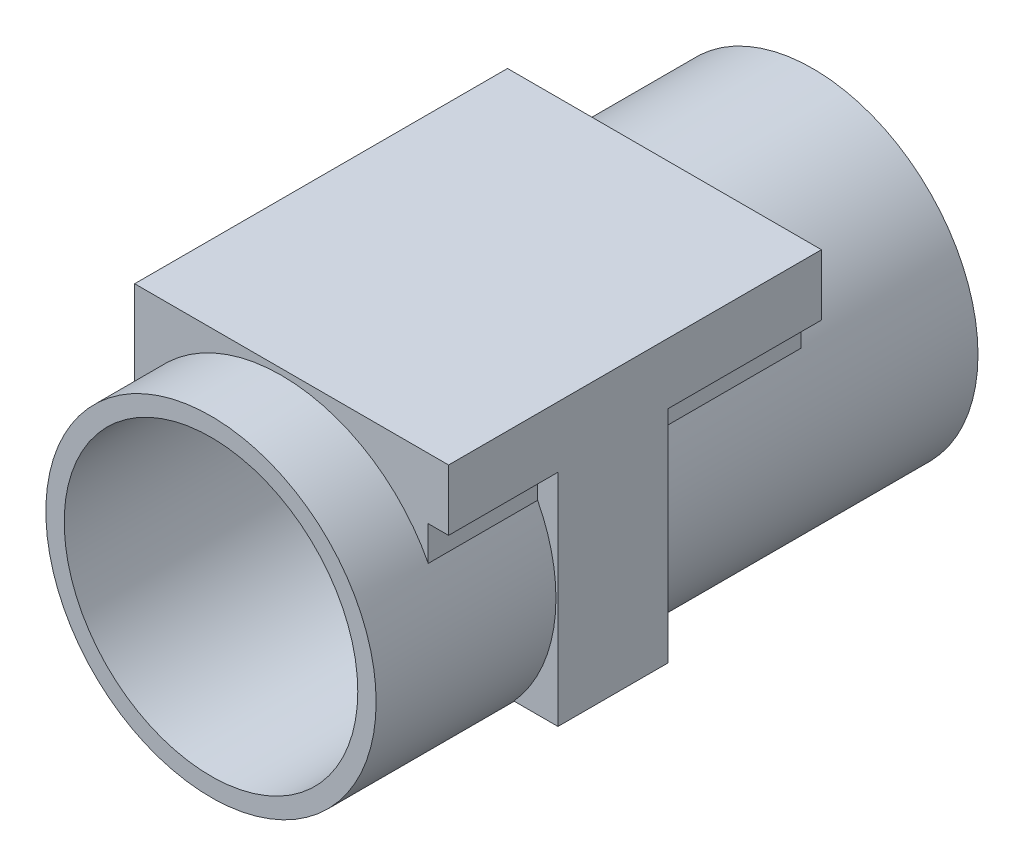
ISO-10303-21;
HEADER;
FILE_DESCRIPTION(('STEP AP214'),'2;1');
FILE_NAME('part.step','',(''),(''),'','','');
FILE_SCHEMA(('AUTOMOTIVE_DESIGN { 1 0 10303 214 1 1 1 1 }'));
ENDSEC;
DATA;
#1=APPLICATION_CONTEXT('core data for automotive mechanical design processes');
#2=APPLICATION_PROTOCOL_DEFINITION('international standard','automotive_design',2000,#1);
#3=PRODUCT_CONTEXT('',#1,'mechanical');
#4=PRODUCT('Part','Part','',(#3));
#5=PRODUCT_RELATED_PRODUCT_CATEGORY('part','',(#4));
#6=PRODUCT_DEFINITION_FORMATION('','',#4);
#7=PRODUCT_DEFINITION_CONTEXT('part definition',#1,'design');
#8=PRODUCT_DEFINITION('design','',#6,#7);
#9=PRODUCT_DEFINITION_SHAPE('','',#8);
#10=(LENGTH_UNIT() NAMED_UNIT(*) SI_UNIT(.MILLI.,.METRE.));
#11=(NAMED_UNIT(*) PLANE_ANGLE_UNIT() SI_UNIT($,.RADIAN.));
#12=(NAMED_UNIT(*) SI_UNIT($,.STERADIAN.) SOLID_ANGLE_UNIT());
#13=UNCERTAINTY_MEASURE_WITH_UNIT(LENGTH_MEASURE(1.E-05),#10,'distance_accuracy_value','');
#14=(GEOMETRIC_REPRESENTATION_CONTEXT(3) GLOBAL_UNCERTAINTY_ASSIGNED_CONTEXT((#13)) GLOBAL_UNIT_ASSIGNED_CONTEXT((#10,
#11,#12)) REPRESENTATION_CONTEXT('',''));
#15=CARTESIAN_POINT('',(0.,0.,0.));
#16=DIRECTION('',(0.,0.,1.));
#17=DIRECTION('',(1.,0.,0.));
#18=AXIS2_PLACEMENT_3D('',#15,#16,#17);
#19=CARTESIAN_POINT('',(0.,0.,0.));
#20=DIRECTION('',(0.,0.,1.));
#21=DIRECTION('',(1.,0.,0.));
#22=AXIS2_PLACEMENT_3D('',#19,#20,#21);
#23=CYLINDRICAL_SURFACE('',#22,22.5);
#24=DIRECTION('',(0.,0.,-1.));
#25=VECTOR('',#24,1.);
#26=CARTESIAN_POINT('',(20.,10.3077640640442,70.4));
#27=LINE('',#26,#25);
#28=CARTESIAN_POINT('',(20.,10.3077640640441,70.4));
#29=VERTEX_POINT('',#28);
#30=CARTESIAN_POINT('',(20.,10.3077640640442,55.5));
#31=VERTEX_POINT('',#30);
#32=EDGE_CURVE('E52',#29,#31,#27,.T.);
#33=ORIENTED_EDGE('',*,*,#32,.F.);
#34=CARTESIAN_POINT('',(0.,-1.6306400674182E-13,70.4));
#35=DIRECTION('',(0.,0.,-1.));
#36=DIRECTION('',(-1.,0.,0.));
#37=AXIS2_PLACEMENT_3D('',#34,#35,#36);
#38=CIRCLE('',#37,22.5000000000001);
#39=CARTESIAN_POINT('',(-20.,10.3077640640441,70.4));
#40=VERTEX_POINT('',#39);
#41=EDGE_CURVE('E56',#40,#29,#38,.T.);
#42=ORIENTED_EDGE('',*,*,#41,.F.);
#43=DIRECTION('',(0.,0.,-1.));
#44=VECTOR('',#43,1.);
#45=CARTESIAN_POINT('',(-20.,10.3077640640442,70.4));
#46=LINE('',#45,#44);
#47=CARTESIAN_POINT('',(-20.,10.3077640640442,19.6));
#48=VERTEX_POINT('',#47);
#49=EDGE_CURVE('E178',#40,#48,#46,.T.);
#50=ORIENTED_EDGE('',*,*,#49,.T.);
#51=CARTESIAN_POINT('',(0.,-1.6306400674182E-13,19.6));
#52=DIRECTION('',(0.,0.,-1.));
#53=DIRECTION('',(-1.,0.,0.));
#54=AXIS2_PLACEMENT_3D('',#51,#52,#53);
#55=CIRCLE('',#54,22.5000000000001);
#56=CARTESIAN_POINT('',(20.,10.3077640640441,19.6));
#57=VERTEX_POINT('',#56);
#58=EDGE_CURVE('E140',#48,#57,#55,.T.);
#59=ORIENTED_EDGE('',*,*,#58,.T.);
#60=CARTESIAN_POINT('',(20.,10.3077640640442,40.5));
#61=VERTEX_POINT('',#60);
#62=EDGE_CURVE('E137',#61,#57,#27,.T.);
#63=ORIENTED_EDGE('',*,*,#62,.F.);
#64=CARTESIAN_POINT('',(0.,0.,40.5));
#65=DIRECTION('',(0.,0.,1.));
#66=DIRECTION('',(-1.,0.,0.));
#67=AXIS2_PLACEMENT_3D('',#64,#65,#66);
#68=CIRCLE('',#67,22.5);
#69=CARTESIAN_POINT('',(16.7705098312484,-15.,40.5));
#70=VERTEX_POINT('',#69);
#71=EDGE_CURVE('E186',#70,#61,#68,.T.);
#72=ORIENTED_EDGE('',*,*,#71,.F.);
#73=DIRECTION('',(0.,0.,-1.));
#74=VECTOR('',#73,1.);
#75=CARTESIAN_POINT('',(16.7705098312484,-15.,55.5));
#76=LINE('',#75,#74);
#77=CARTESIAN_POINT('',(16.7705098312484,-15.,55.5));
#78=VERTEX_POINT('',#77);
#79=EDGE_CURVE('E204',#78,#70,#76,.T.);
#80=ORIENTED_EDGE('',*,*,#79,.F.);
#81=CARTESIAN_POINT('',(0.,0.,55.5));
#82=DIRECTION('',(0.,0.,1.));
#83=DIRECTION('',(-1.,0.,0.));
#84=AXIS2_PLACEMENT_3D('',#81,#82,#83);
#85=CIRCLE('',#84,22.5);
#86=EDGE_CURVE('E195',#78,#31,#85,.T.);
#87=ORIENTED_EDGE('',*,*,#86,.T.);
#88=EDGE_LOOP('',(#33,#42,#50,#59,#63,#72,#80,#87));
#89=FACE_BOUND('',#88,.T.);
#90=CARTESIAN_POINT('',(0.,0.,-2.));
#91=DIRECTION('',(0.,0.,1.));
#92=DIRECTION('',(1.,0.,0.));
#93=AXIS2_PLACEMENT_3D('',#90,#91,#92);
#94=CIRCLE('',#93,22.5);
#95=CARTESIAN_POINT('',(22.5,0.,-2.));
#96=VERTEX_POINT('',#95);
#97=EDGE_CURVE('E45',#96,#96,#94,.T.);
#98=ORIENTED_EDGE('',*,*,#97,.T.);
#99=EDGE_LOOP('',(#98));
#100=FACE_BOUND('',#99,.T.);
#101=CARTESIAN_POINT('',(0.,0.,80.));
#102=DIRECTION('',(0.,0.,1.));
#103=DIRECTION('',(1.,0.,0.));
#104=AXIS2_PLACEMENT_3D('',#101,#102,#103);
#105=CIRCLE('',#104,22.5);
#106=CARTESIAN_POINT('',(22.5,0.,80.));
#107=VERTEX_POINT('',#106);
#108=EDGE_CURVE('E214',#107,#107,#105,.T.);
#109=ORIENTED_EDGE('',*,*,#108,.F.);
#110=EDGE_LOOP('',(#109));
#111=FACE_BOUND('',#110,.T.);
#112=ADVANCED_FACE('F37',(#89,#100,#111),#23,.T.);
#113=CARTESIAN_POINT('',(0.,-20.,0.));
#114=DIRECTION('',(0.,0.,1.));
#115=DIRECTION('',(1.,0.,0.));
#116=AXIS2_PLACEMENT_3D('',#113,#114,#115);
#117=PLANE('',#116);
#118=CARTESIAN_POINT('',(0.,0.,0.));
#119=DIRECTION('',(0.,0.,1.));
#120=DIRECTION('',(1.,0.,0.));
#121=AXIS2_PLACEMENT_3D('',#118,#119,#120);
#122=CIRCLE('',#121,20.);
#123=CARTESIAN_POINT('',(20.,0.,0.));
#124=VERTEX_POINT('',#123);
#125=EDGE_CURVE('E207',#124,#124,#122,.T.);
#126=ORIENTED_EDGE('',*,*,#125,.T.);
#127=EDGE_LOOP('',(#126));
#128=FACE_BOUND('',#127,.T.);
#129=ADVANCED_FACE('F39',(#128),#117,.T.);
#130=CARTESIAN_POINT('',(0.,0.,-2.));
#131=DIRECTION('',(0.,0.,-1.));
#132=DIRECTION('',(-1.,0.,0.));
#133=AXIS2_PLACEMENT_3D('',#130,#131,#132);
#134=PLANE('',#133);
#135=ORIENTED_EDGE('',*,*,#97,.F.);
#136=EDGE_LOOP('',(#135));
#137=FACE_BOUND('',#136,.T.);
#138=ADVANCED_FACE('F221',(#137),#134,.T.);
#139=CARTESIAN_POINT('',(0.,-22.5,80.));
#140=DIRECTION('',(0.,0.,1.));
#141=DIRECTION('',(1.,0.,0.));
#142=AXIS2_PLACEMENT_3D('',#139,#140,#141);
#143=PLANE('',#142);
#144=ORIENTED_EDGE('',*,*,#108,.T.);
#145=EDGE_LOOP('',(#144));
#146=FACE_BOUND('',#145,.T.);
#147=CARTESIAN_POINT('',(0.,0.,80.));
#148=DIRECTION('',(0.,0.,1.));
#149=DIRECTION('',(1.,0.,0.));
#150=AXIS2_PLACEMENT_3D('',#147,#148,#149);
#151=CIRCLE('',#150,20.);
#152=CARTESIAN_POINT('',(20.,0.,80.));
#153=VERTEX_POINT('',#152);
#154=EDGE_CURVE('E211',#153,#153,#151,.T.);
#155=ORIENTED_EDGE('',*,*,#154,.F.);
#156=EDGE_LOOP('',(#155));
#157=FACE_BOUND('',#156,.T.);
#158=ADVANCED_FACE('F223',(#146,#157),#143,.T.);
#159=CARTESIAN_POINT('',(0.,0.,0.));
#160=DIRECTION('',(0.,0.,1.));
#161=DIRECTION('',(1.,0.,0.));
#162=AXIS2_PLACEMENT_3D('',#159,#160,#161);
#163=CYLINDRICAL_SURFACE('',#162,20.);
#164=ORIENTED_EDGE('',*,*,#154,.T.);
#165=EDGE_LOOP('',(#164));
#166=FACE_BOUND('',#165,.T.);
#167=ORIENTED_EDGE('',*,*,#125,.F.);
#168=EDGE_LOOP('',(#167));
#169=FACE_BOUND('',#168,.T.);
#170=ADVANCED_FACE('F228',(#166,#169),#163,.F.);
#171=CARTESIAN_POINT('',(22.7705098312484,-15.,55.5));
#172=DIRECTION('',(0.,-1.,0.));
#173=DIRECTION('',(1.,0.,0.));
#174=AXIS2_PLACEMENT_3D('',#171,#172,#173);
#175=PLANE('',#174);
#176=ORIENTED_EDGE('',*,*,#79,.T.);
#177=DIRECTION('',(-1.,0.,0.));
#178=VECTOR('',#177,1.);
#179=CARTESIAN_POINT('',(22.7705098312484,-15.,40.5));
#180=LINE('',#179,#178);
#181=CARTESIAN_POINT('',(22.7705098312484,-15.,40.5));
#182=VERTEX_POINT('',#181);
#183=EDGE_CURVE('E192',#182,#70,#180,.T.);
#184=ORIENTED_EDGE('',*,*,#183,.F.);
#185=DIRECTION('',(0.,0.,-1.));
#186=VECTOR('',#185,1.);
#187=CARTESIAN_POINT('',(22.7705098312484,-15.,55.5));
#188=LINE('',#187,#186);
#189=CARTESIAN_POINT('',(22.7705098312484,-15.,55.5));
#190=VERTEX_POINT('',#189);
#191=EDGE_CURVE('E203',#190,#182,#188,.T.);
#192=ORIENTED_EDGE('',*,*,#191,.F.);
#193=DIRECTION('',(-1.,0.,0.));
#194=VECTOR('',#193,1.);
#195=CARTESIAN_POINT('',(22.7705098312484,-15.,55.5));
#196=LINE('',#195,#194);
#197=EDGE_CURVE('E200',#190,#78,#196,.T.);
#198=ORIENTED_EDGE('',*,*,#197,.T.);
#199=EDGE_LOOP('',(#176,#184,#192,#198));
#200=FACE_BOUND('',#199,.T.);
#201=ADVANCED_FACE('F239',(#200),#175,.T.);
#202=CARTESIAN_POINT('',(22.7705098312484,15.,55.5));
#203=DIRECTION('',(1.,0.,0.));
#204=DIRECTION('',(0.,0.,-1.));
#205=AXIS2_PLACEMENT_3D('',#202,#203,#204);
#206=PLANE('',#205);
#207=ORIENTED_EDGE('',*,*,#191,.T.);
#208=DIRECTION('',(0.,-1.,0.));
#209=VECTOR('',#208,1.);
#210=CARTESIAN_POINT('',(22.7705098312484,15.,40.5));
#211=LINE('',#210,#209);
#212=CARTESIAN_POINT('',(22.7705098312484,15.,40.5));
#213=VERTEX_POINT('',#212);
#214=EDGE_CURVE('E189',#213,#182,#211,.T.);
#215=ORIENTED_EDGE('',*,*,#214,.F.);
#216=DIRECTION('',(0.,0.,-1.));
#217=VECTOR('',#216,1.);
#218=CARTESIAN_POINT('',(22.7705098312484,15.,70.4));
#219=LINE('',#218,#217);
#220=CARTESIAN_POINT('',(22.7705098312484,15.,19.6));
#221=VERTEX_POINT('',#220);
#222=EDGE_CURVE('E173',#213,#221,#219,.T.);
#223=ORIENTED_EDGE('',*,*,#222,.T.);
#224=DIRECTION('',(0.,1.,0.));
#225=VECTOR('',#224,1.);
#226=CARTESIAN_POINT('',(22.7705098312484,0.,19.6));
#227=LINE('',#226,#225);
#228=CARTESIAN_POINT('',(22.7705098312484,23.3077640640441,19.6));
#229=VERTEX_POINT('',#228);
#230=EDGE_CURVE('E145',#221,#229,#227,.T.);
#231=ORIENTED_EDGE('',*,*,#230,.T.);
#232=DIRECTION('',(0.,0.,-1.));
#233=VECTOR('',#232,1.);
#234=CARTESIAN_POINT('',(22.7705098312484,23.3077640640441,70.4));
#235=LINE('',#234,#233);
#236=CARTESIAN_POINT('',(22.7705098312484,23.3077640640441,70.4));
#237=VERTEX_POINT('',#236);
#238=EDGE_CURVE('E174',#237,#229,#235,.T.);
#239=ORIENTED_EDGE('',*,*,#238,.F.);
#240=DIRECTION('',(0.,1.,0.));
#241=VECTOR('',#240,1.);
#242=CARTESIAN_POINT('',(22.7705098312484,0.,70.4));
#243=LINE('',#242,#241);
#244=CARTESIAN_POINT('',(22.7705098312484,15.,70.4));
#245=VERTEX_POINT('',#244);
#246=EDGE_CURVE('E130',#245,#237,#243,.T.);
#247=ORIENTED_EDGE('',*,*,#246,.F.);
#248=CARTESIAN_POINT('',(22.7705098312484,15.,55.5));
#249=VERTEX_POINT('',#248);
#250=EDGE_CURVE('E169',#245,#249,#219,.T.);
#251=ORIENTED_EDGE('',*,*,#250,.T.);
#252=DIRECTION('',(0.,-1.,0.));
#253=VECTOR('',#252,1.);
#254=CARTESIAN_POINT('',(22.7705098312484,15.,55.5));
#255=LINE('',#254,#253);
#256=EDGE_CURVE('E197',#249,#190,#255,.T.);
#257=ORIENTED_EDGE('',*,*,#256,.T.);
#258=EDGE_LOOP('',(#207,#215,#223,#231,#239,#247,#251,#257));
#259=FACE_BOUND('',#258,.T.);
#260=ADVANCED_FACE('F241',(#259),#206,.T.);
#261=CARTESIAN_POINT('',(0.,0.,55.5));
#262=DIRECTION('',(0.,0.,-1.));
#263=DIRECTION('',(-1.,0.,0.));
#264=AXIS2_PLACEMENT_3D('',#261,#262,#263);
#265=PLANE('',#264);
#266=DIRECTION('',(1.,0.,0.));
#267=VECTOR('',#266,1.);
#268=CARTESIAN_POINT('',(0.,15.,55.5));
#269=LINE('',#268,#267);
#270=CARTESIAN_POINT('',(20.,15.,55.5));
#271=VERTEX_POINT('',#270);
#272=EDGE_CURVE('E183',#271,#249,#269,.T.);
#273=ORIENTED_EDGE('',*,*,#272,.F.);
#274=DIRECTION('',(0.,-1.,0.));
#275=VECTOR('',#274,1.);
#276=CARTESIAN_POINT('',(20.,0.,55.5));
#277=LINE('',#276,#275);
#278=EDGE_CURVE('E172',#271,#31,#277,.T.);
#279=ORIENTED_EDGE('',*,*,#278,.T.);
#280=ORIENTED_EDGE('',*,*,#86,.F.);
#281=ORIENTED_EDGE('',*,*,#197,.F.);
#282=ORIENTED_EDGE('',*,*,#256,.F.);
#283=EDGE_LOOP('',(#273,#279,#280,#281,#282));
#284=FACE_BOUND('',#283,.T.);
#285=ADVANCED_FACE('F244',(#284),#265,.F.);
#286=CARTESIAN_POINT('',(0.,0.,40.5));
#287=DIRECTION('',(0.,0.,-1.));
#288=DIRECTION('',(-1.,0.,0.));
#289=AXIS2_PLACEMENT_3D('',#286,#287,#288);
#290=PLANE('',#289);
#291=DIRECTION('',(0.,-1.,0.));
#292=VECTOR('',#291,1.);
#293=CARTESIAN_POINT('',(20.,0.,40.5));
#294=LINE('',#293,#292);
#295=CARTESIAN_POINT('',(20.,15.,40.5));
#296=VERTEX_POINT('',#295);
#297=EDGE_CURVE('E11',#296,#61,#294,.T.);
#298=ORIENTED_EDGE('',*,*,#297,.F.);
#299=DIRECTION('',(1.,0.,0.));
#300=VECTOR('',#299,1.);
#301=CARTESIAN_POINT('',(16.7705098312484,15.,40.5));
#302=LINE('',#301,#300);
#303=EDGE_CURVE('E127',#296,#213,#302,.T.);
#304=ORIENTED_EDGE('',*,*,#303,.T.);
#305=ORIENTED_EDGE('',*,*,#214,.T.);
#306=ORIENTED_EDGE('',*,*,#183,.T.);
#307=ORIENTED_EDGE('',*,*,#71,.T.);
#308=EDGE_LOOP('',(#298,#304,#305,#306,#307));
#309=FACE_BOUND('',#308,.T.);
#310=ADVANCED_FACE('F251',(#309),#290,.T.);
#311=CARTESIAN_POINT('',(0.,15.,70.4));
#312=DIRECTION('',(0.,1.,0.));
#313=DIRECTION('',(-1.,0.,0.));
#314=AXIS2_PLACEMENT_3D('',#311,#312,#313);
#315=PLANE('',#314);
#316=DIRECTION('',(0.,0.,-1.));
#317=VECTOR('',#316,1.);
#318=CARTESIAN_POINT('',(20.,15.,70.4));
#319=LINE('',#318,#317);
#320=CARTESIAN_POINT('',(20.,15.,70.4));
#321=VERTEX_POINT('',#320);
#322=EDGE_CURVE('E129',#321,#271,#319,.T.);
#323=ORIENTED_EDGE('',*,*,#322,.T.);
#324=ORIENTED_EDGE('',*,*,#272,.T.);
#325=ORIENTED_EDGE('',*,*,#250,.F.);
#326=DIRECTION('',(1.,0.,0.));
#327=VECTOR('',#326,1.);
#328=CARTESIAN_POINT('',(0.,15.,70.4));
#329=LINE('',#328,#327);
#330=EDGE_CURVE('E156',#321,#245,#329,.T.);
#331=ORIENTED_EDGE('',*,*,#330,.F.);
#332=EDGE_LOOP('',(#323,#324,#325,#331));
#333=FACE_BOUND('',#332,.T.);
#334=ADVANCED_FACE('F255',(#333),#315,.F.);
#335=CARTESIAN_POINT('',(20.,0.,70.4));
#336=DIRECTION('',(1.,0.,0.));
#337=DIRECTION('',(0.,1.,0.));
#338=AXIS2_PLACEMENT_3D('',#335,#336,#337);
#339=PLANE('',#338);
#340=ORIENTED_EDGE('',*,*,#278,.F.);
#341=ORIENTED_EDGE('',*,*,#322,.F.);
#342=DIRECTION('',(0.,-1.,0.));
#343=VECTOR('',#342,1.);
#344=CARTESIAN_POINT('',(20.,0.,70.4));
#345=LINE('',#344,#343);
#346=EDGE_CURVE('E159',#321,#29,#345,.T.);
#347=ORIENTED_EDGE('',*,*,#346,.T.);
#348=ORIENTED_EDGE('',*,*,#32,.T.);
#349=EDGE_LOOP('',(#340,#341,#347,#348));
#350=FACE_BOUND('',#349,.T.);
#351=ADVANCED_FACE('F260',(#350),#339,.T.);
#352=ORIENTED_EDGE('',*,*,#303,.F.);
#353=CARTESIAN_POINT('',(20.,15.,19.6));
#354=VERTEX_POINT('',#353);
#355=EDGE_CURVE('E120',#296,#354,#319,.T.);
#356=ORIENTED_EDGE('',*,*,#355,.T.);
#357=DIRECTION('',(1.,0.,0.));
#358=VECTOR('',#357,1.);
#359=CARTESIAN_POINT('',(0.,15.,19.6));
#360=LINE('',#359,#358);
#361=EDGE_CURVE('E125',#354,#221,#360,.T.);
#362=ORIENTED_EDGE('',*,*,#361,.T.);
#363=ORIENTED_EDGE('',*,*,#222,.F.);
#364=EDGE_LOOP('',(#352,#356,#362,#363));
#365=FACE_BOUND('',#364,.T.);
#366=ADVANCED_FACE('F122',(#365),#315,.F.);
#367=CARTESIAN_POINT('',(0.,23.3077640640441,70.4));
#368=DIRECTION('',(0.,-1.,0.));
#369=DIRECTION('',(0.,0.,-1.));
#370=AXIS2_PLACEMENT_3D('',#367,#368,#369);
#371=PLANE('',#370);
#372=ORIENTED_EDGE('',*,*,#238,.T.);
#373=DIRECTION('',(-1.,0.,0.));
#374=VECTOR('',#373,1.);
#375=CARTESIAN_POINT('',(0.,23.3077640640441,19.6));
#376=LINE('',#375,#374);
#377=CARTESIAN_POINT('',(-20.,23.3077640640442,19.6));
#378=VERTEX_POINT('',#377);
#379=EDGE_CURVE('E152',#229,#378,#376,.T.);
#380=ORIENTED_EDGE('',*,*,#379,.T.);
#381=DIRECTION('',(0.,0.,-1.));
#382=VECTOR('',#381,1.);
#383=CARTESIAN_POINT('',(-20.,23.3077640640442,70.4));
#384=LINE('',#383,#382);
#385=CARTESIAN_POINT('',(-20.,23.3077640640442,70.4));
#386=VERTEX_POINT('',#385);
#387=EDGE_CURVE('E176',#386,#378,#384,.T.);
#388=ORIENTED_EDGE('',*,*,#387,.F.);
#389=DIRECTION('',(-1.,0.,0.));
#390=VECTOR('',#389,1.);
#391=CARTESIAN_POINT('',(0.,23.3077640640441,70.4));
#392=LINE('',#391,#390);
#393=EDGE_CURVE('E166',#237,#386,#392,.T.);
#394=ORIENTED_EDGE('',*,*,#393,.F.);
#395=EDGE_LOOP('',(#372,#380,#388,#394));
#396=FACE_BOUND('',#395,.T.);
#397=ADVANCED_FACE('F259',(#396),#371,.F.);
#398=CARTESIAN_POINT('',(-20.,0.,70.4));
#399=DIRECTION('',(-1.,0.,0.));
#400=DIRECTION('',(0.,-1.,0.));
#401=AXIS2_PLACEMENT_3D('',#398,#399,#400);
#402=PLANE('',#401);
#403=ORIENTED_EDGE('',*,*,#387,.T.);
#404=DIRECTION('',(0.,1.,0.));
#405=VECTOR('',#404,1.);
#406=CARTESIAN_POINT('',(-20.,0.,19.6));
#407=LINE('',#406,#405);
#408=EDGE_CURVE('E149',#48,#378,#407,.T.);
#409=ORIENTED_EDGE('',*,*,#408,.F.);
#410=ORIENTED_EDGE('',*,*,#49,.F.);
#411=DIRECTION('',(0.,1.,0.));
#412=VECTOR('',#411,1.);
#413=CARTESIAN_POINT('',(-20.,0.,70.4));
#414=LINE('',#413,#412);
#415=EDGE_CURVE('E163',#40,#386,#414,.T.);
#416=ORIENTED_EDGE('',*,*,#415,.T.);
#417=EDGE_LOOP('',(#403,#409,#410,#416));
#418=FACE_BOUND('',#417,.T.);
#419=ADVANCED_FACE('F264',(#418),#402,.T.);
#420=ORIENTED_EDGE('',*,*,#355,.F.);
#421=ORIENTED_EDGE('',*,*,#297,.T.);
#422=ORIENTED_EDGE('',*,*,#62,.T.);
#423=DIRECTION('',(0.,-1.,0.));
#424=VECTOR('',#423,1.);
#425=CARTESIAN_POINT('',(20.,0.,19.6));
#426=LINE('',#425,#424);
#427=EDGE_CURVE('E134',#354,#57,#426,.T.);
#428=ORIENTED_EDGE('',*,*,#427,.F.);
#429=EDGE_LOOP('',(#420,#421,#422,#428));
#430=FACE_BOUND('',#429,.T.);
#431=ADVANCED_FACE('F135',(#430),#339,.T.);
#432=CARTESIAN_POINT('',(0.,0.,70.4));
#433=DIRECTION('',(0.,0.,-1.));
#434=DIRECTION('',(-1.,0.,0.));
#435=AXIS2_PLACEMENT_3D('',#432,#433,#434);
#436=PLANE('',#435);
#437=ORIENTED_EDGE('',*,*,#330,.T.);
#438=ORIENTED_EDGE('',*,*,#246,.T.);
#439=ORIENTED_EDGE('',*,*,#393,.T.);
#440=ORIENTED_EDGE('',*,*,#415,.F.);
#441=ORIENTED_EDGE('',*,*,#41,.T.);
#442=ORIENTED_EDGE('',*,*,#346,.F.);
#443=EDGE_LOOP('',(#437,#438,#439,#440,#441,#442));
#444=FACE_BOUND('',#443,.T.);
#445=ADVANCED_FACE('F263',(#444),#436,.F.);
#446=CARTESIAN_POINT('',(0.,0.,19.6));
#447=DIRECTION('',(0.,0.,-1.));
#448=DIRECTION('',(-1.,0.,0.));
#449=AXIS2_PLACEMENT_3D('',#446,#447,#448);
#450=PLANE('',#449);
#451=ORIENTED_EDGE('',*,*,#361,.F.);
#452=ORIENTED_EDGE('',*,*,#427,.T.);
#453=ORIENTED_EDGE('',*,*,#58,.F.);
#454=ORIENTED_EDGE('',*,*,#408,.T.);
#455=ORIENTED_EDGE('',*,*,#379,.F.);
#456=ORIENTED_EDGE('',*,*,#230,.F.);
#457=EDGE_LOOP('',(#451,#452,#453,#454,#455,#456));
#458=FACE_BOUND('',#457,.T.);
#459=ADVANCED_FACE('F142',(#458),#450,.T.);
#460=CLOSED_SHELL('',(#112,#129,#138,#158,#170,#201,#260,#285,#310,#334,#351,#366,#397,#419,
#431,#445,#459));
#461=MANIFOLD_SOLID_BREP('B2',#460);
#462=ADVANCED_BREP_SHAPE_REPRESENTATION('',(#18,#461),#14);
#463=SHAPE_DEFINITION_REPRESENTATION(#9,#462);
ENDSEC;
END-ISO-10303-21;
